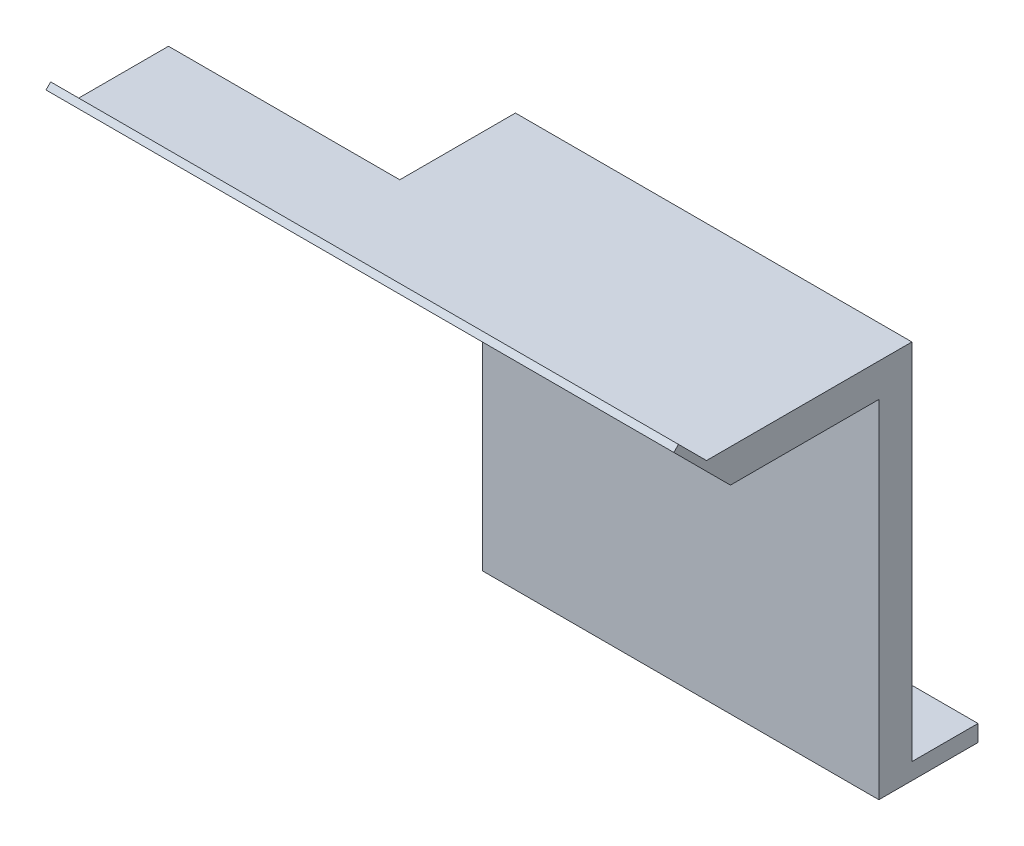
ISO-10303-21;
HEADER;
FILE_DESCRIPTION(('STEP AP214'),'2;1');
FILE_NAME('part.step','',(''),(''),'','','');
FILE_SCHEMA(('AUTOMOTIVE_DESIGN { 1 0 10303 214 1 1 1 1 }'));
ENDSEC;
DATA;
#1=APPLICATION_CONTEXT('core data for automotive mechanical design processes');
#2=APPLICATION_PROTOCOL_DEFINITION('international standard','automotive_design',2000,#1);
#3=PRODUCT_CONTEXT('',#1,'mechanical');
#4=PRODUCT('Part','Part','',(#3));
#5=PRODUCT_RELATED_PRODUCT_CATEGORY('part','',(#4));
#6=PRODUCT_DEFINITION_FORMATION('','',#4);
#7=PRODUCT_DEFINITION_CONTEXT('part definition',#1,'design');
#8=PRODUCT_DEFINITION('design','',#6,#7);
#9=PRODUCT_DEFINITION_SHAPE('','',#8);
#10=(LENGTH_UNIT() NAMED_UNIT(*) SI_UNIT(.MILLI.,.METRE.));
#11=(NAMED_UNIT(*) PLANE_ANGLE_UNIT() SI_UNIT($,.RADIAN.));
#12=(NAMED_UNIT(*) SI_UNIT($,.STERADIAN.) SOLID_ANGLE_UNIT());
#13=UNCERTAINTY_MEASURE_WITH_UNIT(LENGTH_MEASURE(1.E-05),#10,'distance_accuracy_value','');
#14=(GEOMETRIC_REPRESENTATION_CONTEXT(3) GLOBAL_UNCERTAINTY_ASSIGNED_CONTEXT((#13)) GLOBAL_UNIT_ASSIGNED_CONTEXT((#10,
#11,#12)) REPRESENTATION_CONTEXT('',''));
#15=CARTESIAN_POINT('',(0.,0.,0.));
#16=DIRECTION('',(0.,0.,1.));
#17=DIRECTION('',(1.,0.,0.));
#18=AXIS2_PLACEMENT_3D('',#15,#16,#17);
#19=CARTESIAN_POINT('',(-6.94388489208636,6.35,-31.978417266187));
#20=DIRECTION('',(1.,0.,0.));
#21=DIRECTION('',(0.,0.,-1.));
#22=AXIS2_PLACEMENT_3D('',#19,#20,#21);
#23=PLANE('',#22);
#24=DIRECTION('',(0.,0.,1.));
#25=VECTOR('',#24,1.);
#26=CARTESIAN_POINT('',(-6.94388489208636,0.,-31.978417266187));
#27=LINE('',#26,#25);
#28=CARTESIAN_POINT('',(-6.94388489208636,0.,-31.978417266187));
#29=VERTEX_POINT('',#28);
#30=CARTESIAN_POINT('',(-6.94388489208636,0.,6.12158273381296));
#31=VERTEX_POINT('',#30);
#32=EDGE_CURVE('E222',#29,#31,#27,.T.);
#33=ORIENTED_EDGE('',*,*,#32,.T.);
#34=DIRECTION('',(0.,-1.,0.));
#35=VECTOR('',#34,1.);
#36=CARTESIAN_POINT('',(-6.94388489208636,6.35,6.12158273381296));
#37=LINE('',#36,#35);
#38=CARTESIAN_POINT('',(-6.94388489208636,133.256517733172,6.12158273381296));
#39=VERTEX_POINT('',#38);
#40=EDGE_CURVE('E299',#39,#31,#37,.T.);
#41=ORIENTED_EDGE('',*,*,#40,.F.);
#42=DIRECTION('',(0.,0.,-1.));
#43=VECTOR('',#42,1.);
#44=CARTESIAN_POINT('',(-6.94388489208636,133.256517733172,-6.57841726618704));
#45=LINE('',#44,#43);
#46=CARTESIAN_POINT('',(-6.94388489208636,133.256517733172,37.871582733813));
#47=VERTEX_POINT('',#46);
#48=EDGE_CURVE('E11',#47,#39,#45,.T.);
#49=ORIENTED_EDGE('',*,*,#48,.F.);
#50=DIRECTION('',(0.,1.,0.));
#51=VECTOR('',#50,1.);
#52=CARTESIAN_POINT('',(-6.94388489208636,-6.35000000000002,37.871582733813));
#53=LINE('',#52,#51);
#54=CARTESIAN_POINT('',(-6.94388489208636,146.05,37.871582733813));
#55=VERTEX_POINT('',#54);
#56=EDGE_CURVE('E181',#47,#55,#53,.T.);
#57=ORIENTED_EDGE('',*,*,#56,.T.);
#58=DIRECTION('',(0.,0.,-1.));
#59=VECTOR('',#58,1.);
#60=CARTESIAN_POINT('',(-6.94388489208636,146.05,37.871582733813));
#61=LINE('',#60,#59);
#62=CARTESIAN_POINT('',(-6.94388489208636,146.05,-6.57841726618705));
#63=VERTEX_POINT('',#62);
#64=EDGE_CURVE('E173',#55,#63,#61,.T.);
#65=ORIENTED_EDGE('',*,*,#64,.T.);
#66=DIRECTION('',(0.,-1.,0.));
#67=VECTOR('',#66,1.);
#68=CARTESIAN_POINT('',(-6.94388489208636,146.05,-6.57841726618704));
#69=LINE('',#68,#67);
#70=CARTESIAN_POINT('',(-6.94388489208636,6.35,-6.57841726618704));
#71=VERTEX_POINT('',#70);
#72=EDGE_CURVE('E208',#63,#71,#69,.T.);
#73=ORIENTED_EDGE('',*,*,#72,.T.);
#74=DIRECTION('',(0.,0.,1.));
#75=VECTOR('',#74,1.);
#76=CARTESIAN_POINT('',(-6.94388489208636,6.35,-31.978417266187));
#77=LINE('',#76,#75);
#78=CARTESIAN_POINT('',(-6.94388489208636,6.35,-31.978417266187));
#79=VERTEX_POINT('',#78);
#80=EDGE_CURVE('E266',#79,#71,#77,.T.);
#81=ORIENTED_EDGE('',*,*,#80,.F.);
#82=DIRECTION('',(0.,-1.,0.));
#83=VECTOR('',#82,1.);
#84=CARTESIAN_POINT('',(-6.94388489208636,6.35,-31.978417266187));
#85=LINE('',#84,#83);
#86=EDGE_CURVE('E277',#79,#29,#85,.T.);
#87=ORIENTED_EDGE('',*,*,#86,.T.);
#88=EDGE_LOOP('',(#33,#41,#49,#57,#65,#73,#81,#87));
#89=FACE_BOUND('',#88,.T.);
#90=ADVANCED_FACE('F39',(#89),#23,.F.);
#91=CARTESIAN_POINT('',(-6.94388489208636,6.35,6.12158273381296));
#92=DIRECTION('',(0.,0.,-1.));
#93=DIRECTION('',(-1.,0.,0.));
#94=AXIS2_PLACEMENT_3D('',#91,#92,#93);
#95=PLANE('',#94);
#96=DIRECTION('',(1.,0.,0.));
#97=VECTOR('',#96,1.);
#98=CARTESIAN_POINT('',(-6.94388489208636,133.256517733172,6.12158273381296));
#99=LINE('',#98,#97);
#100=CARTESIAN_POINT('',(145.456115107914,133.256517733172,6.12158273381296));
#101=VERTEX_POINT('',#100);
#102=EDGE_CURVE('E196',#39,#101,#99,.T.);
#103=ORIENTED_EDGE('',*,*,#102,.F.);
#104=ORIENTED_EDGE('',*,*,#40,.T.);
#105=DIRECTION('',(1.,0.,0.));
#106=VECTOR('',#105,1.);
#107=CARTESIAN_POINT('',(-6.94388489208636,0.,6.12158273381296));
#108=LINE('',#107,#106);
#109=CARTESIAN_POINT('',(145.456115107914,0.,6.12158273381296));
#110=VERTEX_POINT('',#109);
#111=EDGE_CURVE('E280',#31,#110,#108,.T.);
#112=ORIENTED_EDGE('',*,*,#111,.T.);
#113=DIRECTION('',(0.,-1.,0.));
#114=VECTOR('',#113,1.);
#115=CARTESIAN_POINT('',(145.456115107914,6.35,6.12158273381296));
#116=LINE('',#115,#114);
#117=EDGE_CURVE('E296',#101,#110,#116,.T.);
#118=ORIENTED_EDGE('',*,*,#117,.F.);
#119=EDGE_LOOP('',(#103,#104,#112,#118));
#120=FACE_BOUND('',#119,.T.);
#121=ADVANCED_FACE('F328',(#120),#95,.F.);
#122=CARTESIAN_POINT('',(145.456115107914,6.35,-31.978417266187));
#123=DIRECTION('',(-1.,0.,0.));
#124=DIRECTION('',(0.,0.,1.));
#125=AXIS2_PLACEMENT_3D('',#122,#123,#124);
#126=PLANE('',#125);
#127=DIRECTION('',(0.,-0.707106781186549,-0.707106781186546));
#128=VECTOR('',#127,1.);
#129=CARTESIAN_POINT('',(145.456115107914,146.05,75.971582733813));
#130=LINE('',#129,#128);
#131=CARTESIAN_POINT('',(145.456115107914,155.030256121069,84.9518388548821));
#132=VERTEX_POINT('',#131);
#133=CARTESIAN_POINT('',(145.456115107914,133.256517733172,63.1781004669848));
#134=VERTEX_POINT('',#133);
#135=EDGE_CURVE('E130',#132,#134,#130,.T.);
#136=ORIENTED_EDGE('',*,*,#135,.T.);
#137=DIRECTION('',(0.,0.,1.));
#138=VECTOR('',#137,1.);
#139=CARTESIAN_POINT('',(145.456115107914,133.256517733172,-6.57841726618704));
#140=LINE('',#139,#138);
#141=EDGE_CURVE('E186',#101,#134,#140,.T.);
#142=ORIENTED_EDGE('',*,*,#141,.F.);
#143=ORIENTED_EDGE('',*,*,#117,.T.);
#144=DIRECTION('',(0.,0.,-1.));
#145=VECTOR('',#144,1.);
#146=CARTESIAN_POINT('',(145.456115107914,0.,-31.978417266187));
#147=LINE('',#146,#145);
#148=CARTESIAN_POINT('',(145.456115107914,0.,-31.978417266187));
#149=VERTEX_POINT('',#148);
#150=EDGE_CURVE('E284',#110,#149,#147,.T.);
#151=ORIENTED_EDGE('',*,*,#150,.T.);
#152=DIRECTION('',(0.,-1.,0.));
#153=VECTOR('',#152,1.);
#154=CARTESIAN_POINT('',(145.456115107914,6.35,-31.978417266187));
#155=LINE('',#154,#153);
#156=CARTESIAN_POINT('',(145.456115107914,6.35,-31.978417266187));
#157=VERTEX_POINT('',#156);
#158=EDGE_CURVE('E292',#157,#149,#155,.T.);
#159=ORIENTED_EDGE('',*,*,#158,.F.);
#160=DIRECTION('',(0.,0.,-1.));
#161=VECTOR('',#160,1.);
#162=CARTESIAN_POINT('',(145.456115107914,6.35,-31.978417266187));
#163=LINE('',#162,#161);
#164=CARTESIAN_POINT('',(145.456115107914,6.35,-6.57841726618705));
#165=VERTEX_POINT('',#164);
#166=EDGE_CURVE('E270',#165,#157,#163,.T.);
#167=ORIENTED_EDGE('',*,*,#166,.F.);
#168=DIRECTION('',(0.,-1.,0.));
#169=VECTOR('',#168,1.);
#170=CARTESIAN_POINT('',(145.456115107914,146.05,-6.57841726618704));
#171=LINE('',#170,#169);
#172=CARTESIAN_POINT('',(145.456115107914,146.05,-6.57841726618704));
#173=VERTEX_POINT('',#172);
#174=EDGE_CURVE('E214',#173,#165,#171,.T.);
#175=ORIENTED_EDGE('',*,*,#174,.F.);
#176=DIRECTION('',(0.,0.,-1.));
#177=VECTOR('',#176,1.);
#178=CARTESIAN_POINT('',(145.456115107914,146.05,-6.57841726618704));
#179=LINE('',#178,#177);
#180=CARTESIAN_POINT('',(145.456115107914,146.05,72.3794802853852));
#181=VERTEX_POINT('',#180);
#182=EDGE_CURVE('E201',#181,#173,#179,.T.);
#183=ORIENTED_EDGE('',*,*,#182,.F.);
#184=DIRECTION('',(0.,-0.707106781186548,-0.707106781186547));
#185=VECTOR('',#184,1.);
#186=CARTESIAN_POINT('',(145.456115107914,156.826307345283,83.1557876306682));
#187=LINE('',#186,#185);
#188=CARTESIAN_POINT('',(145.456115107914,156.826307345283,83.1557876306682));
#189=VERTEX_POINT('',#188);
#190=EDGE_CURVE('E150',#189,#181,#187,.T.);
#191=ORIENTED_EDGE('',*,*,#190,.F.);
#192=DIRECTION('',(0.,0.707106781186548,-0.707106781186548));
#193=VECTOR('',#192,1.);
#194=CARTESIAN_POINT('',(145.456115107914,155.030256121069,84.9518388548821));
#195=LINE('',#194,#193);
#196=EDGE_CURVE('E146',#132,#189,#195,.T.);
#197=ORIENTED_EDGE('',*,*,#196,.F.);
#198=EDGE_LOOP('',(#136,#142,#143,#151,#159,#167,#175,#183,#191,#197));
#199=FACE_BOUND('',#198,.T.);
#200=ADVANCED_FACE('F153',(#199),#126,.F.);
#201=CARTESIAN_POINT('',(-6.94388489208636,6.35,-31.978417266187));
#202=DIRECTION('',(0.,0.,1.));
#203=DIRECTION('',(1.,0.,0.));
#204=AXIS2_PLACEMENT_3D('',#201,#202,#203);
#205=PLANE('',#204);
#206=DIRECTION('',(-1.,0.,0.));
#207=VECTOR('',#206,1.);
#208=CARTESIAN_POINT('',(-6.94388489208636,0.,-31.978417266187));
#209=LINE('',#208,#207);
#210=EDGE_CURVE('E271',#149,#29,#209,.T.);
#211=ORIENTED_EDGE('',*,*,#210,.T.);
#212=ORIENTED_EDGE('',*,*,#86,.F.);
#213=DIRECTION('',(-1.,0.,0.));
#214=VECTOR('',#213,1.);
#215=CARTESIAN_POINT('',(-6.94388489208636,6.35,-31.978417266187));
#216=LINE('',#215,#214);
#217=EDGE_CURVE('E274',#157,#79,#216,.T.);
#218=ORIENTED_EDGE('',*,*,#217,.F.);
#219=ORIENTED_EDGE('',*,*,#158,.T.);
#220=EDGE_LOOP('',(#211,#212,#218,#219));
#221=FACE_BOUND('',#220,.T.);
#222=ADVANCED_FACE('F336',(#221),#205,.F.);
#223=CARTESIAN_POINT('',(0.,6.35,0.));
#224=DIRECTION('',(0.,1.,0.));
#225=DIRECTION('',(0.,0.,1.));
#226=AXIS2_PLACEMENT_3D('',#223,#224,#225);
#227=PLANE('',#226);
#228=DIRECTION('',(-1.,0.,0.));
#229=VECTOR('',#228,1.);
#230=CARTESIAN_POINT('',(-6.94388489208636,6.35,-6.57841726618704));
#231=LINE('',#230,#229);
#232=EDGE_CURVE('E200',#165,#71,#231,.T.);
#233=ORIENTED_EDGE('',*,*,#232,.F.);
#234=ORIENTED_EDGE('',*,*,#166,.T.);
#235=ORIENTED_EDGE('',*,*,#217,.T.);
#236=ORIENTED_EDGE('',*,*,#80,.T.);
#237=EDGE_LOOP('',(#233,#234,#235,#236));
#238=FACE_BOUND('',#237,.T.);
#239=CARTESIAN_POINT('',(-0.593884892086366,6.35,-12.928417266187));
#240=DIRECTION('',(0.,1.,0.));
#241=DIRECTION('',(0.,0.,1.));
#242=AXIS2_PLACEMENT_3D('',#239,#240,#241);
#243=CIRCLE('',#242,3.175);
#244=CARTESIAN_POINT('',(-0.593884892086366,6.35,-9.75341726618704));
#245=VERTEX_POINT('',#244);
#246=EDGE_CURVE('E223',#245,#245,#243,.T.);
#247=ORIENTED_EDGE('',*,*,#246,.F.);
#248=EDGE_LOOP('',(#247));
#249=FACE_BOUND('',#248,.T.);
#250=CARTESIAN_POINT('',(24.8061151079136,6.35,-12.928417266187));
#251=DIRECTION('',(0.,1.,0.));
#252=DIRECTION('',(0.,0.,1.));
#253=AXIS2_PLACEMENT_3D('',#250,#251,#252);
#254=CIRCLE('',#253,3.175);
#255=CARTESIAN_POINT('',(24.8061151079136,6.35,-9.75341726618704));
#256=VERTEX_POINT('',#255);
#257=EDGE_CURVE('E231',#256,#256,#254,.T.);
#258=ORIENTED_EDGE('',*,*,#257,.F.);
#259=EDGE_LOOP('',(#258));
#260=FACE_BOUND('',#259,.T.);
#261=CARTESIAN_POINT('',(50.2061151079136,6.35,-12.928417266187));
#262=DIRECTION('',(0.,1.,0.));
#263=DIRECTION('',(0.,0.,1.));
#264=AXIS2_PLACEMENT_3D('',#261,#262,#263);
#265=CIRCLE('',#264,3.175);
#266=CARTESIAN_POINT('',(50.2061151079136,6.35,-9.75341726618705));
#267=VERTEX_POINT('',#266);
#268=EDGE_CURVE('E239',#267,#267,#265,.T.);
#269=ORIENTED_EDGE('',*,*,#268,.F.);
#270=EDGE_LOOP('',(#269));
#271=FACE_BOUND('',#270,.T.);
#272=CARTESIAN_POINT('',(75.6061151079136,6.35,-12.928417266187));
#273=DIRECTION('',(0.,1.,0.));
#274=DIRECTION('',(0.,0.,1.));
#275=AXIS2_PLACEMENT_3D('',#272,#273,#274);
#276=CIRCLE('',#275,3.175);
#277=CARTESIAN_POINT('',(75.6061151079136,6.35,-9.75341726618705));
#278=VERTEX_POINT('',#277);
#279=EDGE_CURVE('E247',#278,#278,#276,.T.);
#280=ORIENTED_EDGE('',*,*,#279,.F.);
#281=EDGE_LOOP('',(#280));
#282=FACE_BOUND('',#281,.T.);
#283=CARTESIAN_POINT('',(101.006115107914,6.35,-12.928417266187));
#284=DIRECTION('',(0.,1.,0.));
#285=DIRECTION('',(0.,0.,1.));
#286=AXIS2_PLACEMENT_3D('',#283,#284,#285);
#287=CIRCLE('',#286,3.175);
#288=CARTESIAN_POINT('',(101.006115107914,6.35,-9.75341726618705));
#289=VERTEX_POINT('',#288);
#290=EDGE_CURVE('E255',#289,#289,#287,.T.);
#291=ORIENTED_EDGE('',*,*,#290,.F.);
#292=EDGE_LOOP('',(#291));
#293=FACE_BOUND('',#292,.T.);
#294=CARTESIAN_POINT('',(126.406115107914,6.35,-12.928417266187));
#295=DIRECTION('',(0.,1.,0.));
#296=DIRECTION('',(0.,0.,1.));
#297=AXIS2_PLACEMENT_3D('',#294,#295,#296);
#298=CIRCLE('',#297,3.175);
#299=CARTESIAN_POINT('',(126.406115107914,6.35,-9.75341726618705));
#300=VERTEX_POINT('',#299);
#301=EDGE_CURVE('E217',#300,#300,#298,.T.);
#302=ORIENTED_EDGE('',*,*,#301,.F.);
#303=EDGE_LOOP('',(#302));
#304=FACE_BOUND('',#303,.T.);
#305=ADVANCED_FACE('F341',(#238,#249,#260,#271,#282,#293,#304),#227,.T.);
#306=CARTESIAN_POINT('',(0.,0.,0.));
#307=DIRECTION('',(0.,1.,0.));
#308=DIRECTION('',(0.,0.,1.));
#309=AXIS2_PLACEMENT_3D('',#306,#307,#308);
#310=PLANE('',#309);
#311=CARTESIAN_POINT('',(-0.593884892086366,0.,-12.928417266187));
#312=DIRECTION('',(0.,1.,0.));
#313=DIRECTION('',(0.,0.,1.));
#314=AXIS2_PLACEMENT_3D('',#311,#312,#313);
#315=CIRCLE('',#314,3.175);
#316=CARTESIAN_POINT('',(-0.593884892086366,0.,-9.75341726618704));
#317=VERTEX_POINT('',#316);
#318=EDGE_CURVE('E218',#317,#317,#315,.T.);
#319=ORIENTED_EDGE('',*,*,#318,.T.);
#320=EDGE_LOOP('',(#319));
#321=FACE_BOUND('',#320,.T.);
#322=CARTESIAN_POINT('',(24.8061151079136,0.,-12.928417266187));
#323=DIRECTION('',(0.,1.,0.));
#324=DIRECTION('',(0.,0.,1.));
#325=AXIS2_PLACEMENT_3D('',#322,#323,#324);
#326=CIRCLE('',#325,3.175);
#327=CARTESIAN_POINT('',(24.8061151079136,0.,-9.75341726618704));
#328=VERTEX_POINT('',#327);
#329=EDGE_CURVE('E227',#328,#328,#326,.T.);
#330=ORIENTED_EDGE('',*,*,#329,.T.);
#331=EDGE_LOOP('',(#330));
#332=FACE_BOUND('',#331,.T.);
#333=CARTESIAN_POINT('',(50.2061151079136,0.,-12.928417266187));
#334=DIRECTION('',(0.,1.,0.));
#335=DIRECTION('',(0.,0.,1.));
#336=AXIS2_PLACEMENT_3D('',#333,#334,#335);
#337=CIRCLE('',#336,3.175);
#338=CARTESIAN_POINT('',(50.2061151079136,0.,-9.75341726618705));
#339=VERTEX_POINT('',#338);
#340=EDGE_CURVE('E235',#339,#339,#337,.T.);
#341=ORIENTED_EDGE('',*,*,#340,.T.);
#342=EDGE_LOOP('',(#341));
#343=FACE_BOUND('',#342,.T.);
#344=CARTESIAN_POINT('',(75.6061151079136,0.,-12.928417266187));
#345=DIRECTION('',(0.,1.,0.));
#346=DIRECTION('',(0.,0.,1.));
#347=AXIS2_PLACEMENT_3D('',#344,#345,#346);
#348=CIRCLE('',#347,3.175);
#349=CARTESIAN_POINT('',(75.6061151079136,0.,-9.75341726618705));
#350=VERTEX_POINT('',#349);
#351=EDGE_CURVE('E243',#350,#350,#348,.T.);
#352=ORIENTED_EDGE('',*,*,#351,.T.);
#353=EDGE_LOOP('',(#352));
#354=FACE_BOUND('',#353,.T.);
#355=CARTESIAN_POINT('',(101.006115107914,0.,-12.928417266187));
#356=DIRECTION('',(0.,1.,0.));
#357=DIRECTION('',(0.,0.,1.));
#358=AXIS2_PLACEMENT_3D('',#355,#356,#357);
#359=CIRCLE('',#358,3.175);
#360=CARTESIAN_POINT('',(101.006115107914,0.,-9.75341726618705));
#361=VERTEX_POINT('',#360);
#362=EDGE_CURVE('E251',#361,#361,#359,.T.);
#363=ORIENTED_EDGE('',*,*,#362,.T.);
#364=EDGE_LOOP('',(#363));
#365=FACE_BOUND('',#364,.T.);
#366=CARTESIAN_POINT('',(126.406115107914,0.,-12.928417266187));
#367=DIRECTION('',(0.,1.,0.));
#368=DIRECTION('',(0.,0.,1.));
#369=AXIS2_PLACEMENT_3D('',#366,#367,#368);
#370=CIRCLE('',#369,3.175);
#371=CARTESIAN_POINT('',(126.406115107914,0.,-9.75341726618705));
#372=VERTEX_POINT('',#371);
#373=EDGE_CURVE('E259',#372,#372,#370,.T.);
#374=ORIENTED_EDGE('',*,*,#373,.T.);
#375=EDGE_LOOP('',(#374));
#376=FACE_BOUND('',#375,.T.);
#377=ORIENTED_EDGE('',*,*,#32,.F.);
#378=ORIENTED_EDGE('',*,*,#210,.F.);
#379=ORIENTED_EDGE('',*,*,#150,.F.);
#380=ORIENTED_EDGE('',*,*,#111,.F.);
#381=EDGE_LOOP('',(#377,#378,#379,#380));
#382=FACE_BOUND('',#381,.T.);
#383=ADVANCED_FACE('F343',(#321,#332,#343,#354,#365,#376,#382),#310,.F.);
#384=CARTESIAN_POINT('',(126.406115107914,0.,-12.928417266187));
#385=DIRECTION('',(0.,1.,0.));
#386=DIRECTION('',(0.,0.,1.));
#387=AXIS2_PLACEMENT_3D('',#384,#385,#386);
#388=CYLINDRICAL_SURFACE('',#387,3.175);
#389=ORIENTED_EDGE('',*,*,#373,.F.);
#390=EDGE_LOOP('',(#389));
#391=FACE_BOUND('',#390,.T.);
#392=ORIENTED_EDGE('',*,*,#301,.T.);
#393=EDGE_LOOP('',(#392));
#394=FACE_BOUND('',#393,.T.);
#395=ADVANCED_FACE('F346',(#391,#394),#388,.F.);
#396=CARTESIAN_POINT('',(101.006115107914,0.,-12.928417266187));
#397=DIRECTION('',(0.,1.,0.));
#398=DIRECTION('',(0.,0.,1.));
#399=AXIS2_PLACEMENT_3D('',#396,#397,#398);
#400=CYLINDRICAL_SURFACE('',#399,3.175);
#401=ORIENTED_EDGE('',*,*,#362,.F.);
#402=EDGE_LOOP('',(#401));
#403=FACE_BOUND('',#402,.T.);
#404=ORIENTED_EDGE('',*,*,#290,.T.);
#405=EDGE_LOOP('',(#404));
#406=FACE_BOUND('',#405,.T.);
#407=ADVANCED_FACE('F353',(#403,#406),#400,.F.);
#408=CARTESIAN_POINT('',(75.6061151079136,0.,-12.928417266187));
#409=DIRECTION('',(0.,1.,0.));
#410=DIRECTION('',(0.,0.,1.));
#411=AXIS2_PLACEMENT_3D('',#408,#409,#410);
#412=CYLINDRICAL_SURFACE('',#411,3.175);
#413=ORIENTED_EDGE('',*,*,#351,.F.);
#414=EDGE_LOOP('',(#413));
#415=FACE_BOUND('',#414,.T.);
#416=ORIENTED_EDGE('',*,*,#279,.T.);
#417=EDGE_LOOP('',(#416));
#418=FACE_BOUND('',#417,.T.);
#419=ADVANCED_FACE('F357',(#415,#418),#412,.F.);
#420=CARTESIAN_POINT('',(50.2061151079136,0.,-12.928417266187));
#421=DIRECTION('',(0.,1.,0.));
#422=DIRECTION('',(0.,0.,1.));
#423=AXIS2_PLACEMENT_3D('',#420,#421,#422);
#424=CYLINDRICAL_SURFACE('',#423,3.175);
#425=ORIENTED_EDGE('',*,*,#340,.F.);
#426=EDGE_LOOP('',(#425));
#427=FACE_BOUND('',#426,.T.);
#428=ORIENTED_EDGE('',*,*,#268,.T.);
#429=EDGE_LOOP('',(#428));
#430=FACE_BOUND('',#429,.T.);
#431=ADVANCED_FACE('F361',(#427,#430),#424,.F.);
#432=CARTESIAN_POINT('',(24.8061151079136,0.,-12.928417266187));
#433=DIRECTION('',(0.,1.,0.));
#434=DIRECTION('',(0.,0.,1.));
#435=AXIS2_PLACEMENT_3D('',#432,#433,#434);
#436=CYLINDRICAL_SURFACE('',#435,3.175);
#437=ORIENTED_EDGE('',*,*,#329,.F.);
#438=EDGE_LOOP('',(#437));
#439=FACE_BOUND('',#438,.T.);
#440=ORIENTED_EDGE('',*,*,#257,.T.);
#441=EDGE_LOOP('',(#440));
#442=FACE_BOUND('',#441,.T.);
#443=ADVANCED_FACE('F365',(#439,#442),#436,.F.);
#444=CARTESIAN_POINT('',(-0.593884892086366,0.,-12.928417266187));
#445=DIRECTION('',(0.,1.,0.));
#446=DIRECTION('',(0.,0.,1.));
#447=AXIS2_PLACEMENT_3D('',#444,#445,#446);
#448=CYLINDRICAL_SURFACE('',#447,3.175);
#449=ORIENTED_EDGE('',*,*,#318,.F.);
#450=EDGE_LOOP('',(#449));
#451=FACE_BOUND('',#450,.T.);
#452=ORIENTED_EDGE('',*,*,#246,.T.);
#453=EDGE_LOOP('',(#452));
#454=FACE_BOUND('',#453,.T.);
#455=ADVANCED_FACE('F369',(#451,#454),#448,.F.);
#456=CARTESIAN_POINT('',(-6.94388489208636,146.05,-6.57841726618704));
#457=DIRECTION('',(0.,0.,1.));
#458=DIRECTION('',(1.,0.,0.));
#459=AXIS2_PLACEMENT_3D('',#456,#457,#458);
#460=PLANE('',#459);
#461=ORIENTED_EDGE('',*,*,#72,.F.);
#462=DIRECTION('',(-1.,0.,0.));
#463=VECTOR('',#462,1.);
#464=CARTESIAN_POINT('',(-6.94388489208636,146.05,-6.57841726618704));
#465=LINE('',#464,#463);
#466=EDGE_CURVE('E204',#173,#63,#465,.T.);
#467=ORIENTED_EDGE('',*,*,#466,.F.);
#468=ORIENTED_EDGE('',*,*,#174,.T.);
#469=ORIENTED_EDGE('',*,*,#232,.T.);
#470=EDGE_LOOP('',(#461,#467,#468,#469));
#471=FACE_BOUND('',#470,.T.);
#472=ADVANCED_FACE('F373',(#471),#460,.F.);
#473=CARTESIAN_POINT('',(0.,146.05,0.));
#474=DIRECTION('',(0.,1.,0.));
#475=DIRECTION('',(0.,0.,1.));
#476=AXIS2_PLACEMENT_3D('',#473,#474,#475);
#477=PLANE('',#476);
#478=DIRECTION('',(-1.,0.,0.));
#479=VECTOR('',#478,1.);
#480=CARTESIAN_POINT('',(0.,146.05,72.3794802853852));
#481=LINE('',#480,#479);
#482=CARTESIAN_POINT('',(-95.8438848920864,146.05,72.3794802853853));
#483=VERTEX_POINT('',#482);
#484=EDGE_CURVE('E165',#181,#483,#481,.T.);
#485=ORIENTED_EDGE('',*,*,#484,.F.);
#486=ORIENTED_EDGE('',*,*,#182,.T.);
#487=ORIENTED_EDGE('',*,*,#466,.T.);
#488=ORIENTED_EDGE('',*,*,#64,.F.);
#489=DIRECTION('',(1.,0.,0.));
#490=VECTOR('',#489,1.);
#491=CARTESIAN_POINT('',(-6.94388489208636,146.05,37.871582733813));
#492=LINE('',#491,#490);
#493=CARTESIAN_POINT('',(-95.8438848920864,146.05,37.871582733813));
#494=VERTEX_POINT('',#493);
#495=EDGE_CURVE('E177',#494,#55,#492,.T.);
#496=ORIENTED_EDGE('',*,*,#495,.F.);
#497=DIRECTION('',(0.,0.,-1.));
#498=VECTOR('',#497,1.);
#499=CARTESIAN_POINT('',(-95.8438848920864,146.05,-6.57841726618704));
#500=LINE('',#499,#498);
#501=EDGE_CURVE('E193',#483,#494,#500,.T.);
#502=ORIENTED_EDGE('',*,*,#501,.F.);
#503=EDGE_LOOP('',(#485,#486,#487,#488,#496,#502));
#504=FACE_BOUND('',#503,.T.);
#505=ADVANCED_FACE('F310',(#504),#477,.T.);
#506=CARTESIAN_POINT('',(-95.8438848920864,133.256517733172,-6.57841726618704));
#507=DIRECTION('',(0.,1.,0.));
#508=DIRECTION('',(0.,0.,1.));
#509=AXIS2_PLACEMENT_3D('',#506,#507,#508);
#510=PLANE('',#509);
#511=ORIENTED_EDGE('',*,*,#141,.T.);
#512=DIRECTION('',(-1.,0.,0.));
#513=VECTOR('',#512,1.);
#514=CARTESIAN_POINT('',(145.456115107914,133.256517733172,63.1781004669848));
#515=LINE('',#514,#513);
#516=CARTESIAN_POINT('',(-95.8438848920864,133.256517733172,63.1781004669848));
#517=VERTEX_POINT('',#516);
#518=EDGE_CURVE('E136',#134,#517,#515,.T.);
#519=ORIENTED_EDGE('',*,*,#518,.T.);
#520=DIRECTION('',(0.,0.,1.));
#521=VECTOR('',#520,1.);
#522=CARTESIAN_POINT('',(-95.8438848920864,133.256517733172,-6.57841726618704));
#523=LINE('',#522,#521);
#524=CARTESIAN_POINT('',(-95.8438848920864,133.256517733172,37.871582733813));
#525=VERTEX_POINT('',#524);
#526=EDGE_CURVE('E189',#525,#517,#523,.T.);
#527=ORIENTED_EDGE('',*,*,#526,.F.);
#528=DIRECTION('',(1.,0.,0.));
#529=VECTOR('',#528,1.);
#530=CARTESIAN_POINT('',(-95.8438848920864,133.256517733172,37.871582733813));
#531=LINE('',#530,#529);
#532=EDGE_CURVE('E62',#525,#47,#531,.T.);
#533=ORIENTED_EDGE('',*,*,#532,.T.);
#534=ORIENTED_EDGE('',*,*,#48,.T.);
#535=ORIENTED_EDGE('',*,*,#102,.T.);
#536=EDGE_LOOP('',(#511,#519,#527,#533,#534,#535));
#537=FACE_BOUND('',#536,.T.);
#538=ADVANCED_FACE('F316',(#537),#510,.F.);
#539=CARTESIAN_POINT('',(-95.8438848920864,0.,0.));
#540=DIRECTION('',(-1.,0.,0.));
#541=DIRECTION('',(0.,0.,1.));
#542=AXIS2_PLACEMENT_3D('',#539,#540,#541);
#543=PLANE('',#542);
#544=ORIENTED_EDGE('',*,*,#526,.T.);
#545=DIRECTION('',(0.,-0.707106781186549,-0.707106781186546));
#546=VECTOR('',#545,1.);
#547=CARTESIAN_POINT('',(-95.8438848920864,146.05,75.971582733813));
#548=LINE('',#547,#546);
#549=CARTESIAN_POINT('',(-95.8438848920864,155.030256121069,84.9518388548821));
#550=VERTEX_POINT('',#549);
#551=EDGE_CURVE('E141',#550,#517,#548,.T.);
#552=ORIENTED_EDGE('',*,*,#551,.F.);
#553=DIRECTION('',(0.,0.707106781186548,-0.707106781186548));
#554=VECTOR('',#553,1.);
#555=CARTESIAN_POINT('',(-95.8438848920864,155.030256121069,84.9518388548821));
#556=LINE('',#555,#554);
#557=CARTESIAN_POINT('',(-95.8438848920864,156.826307345283,83.1557876306682));
#558=VERTEX_POINT('',#557);
#559=EDGE_CURVE('E147',#550,#558,#556,.T.);
#560=ORIENTED_EDGE('',*,*,#559,.T.);
#561=DIRECTION('',(0.,-0.707106781186548,-0.707106781186547));
#562=VECTOR('',#561,1.);
#563=CARTESIAN_POINT('',(-95.8438848920864,156.826307345283,83.1557876306682));
#564=LINE('',#563,#562);
#565=EDGE_CURVE('E54',#558,#483,#564,.T.);
#566=ORIENTED_EDGE('',*,*,#565,.T.);
#567=ORIENTED_EDGE('',*,*,#501,.T.);
#568=DIRECTION('',(0.,1.,0.));
#569=VECTOR('',#568,1.);
#570=CARTESIAN_POINT('',(-95.8438848920864,0.,37.871582733813));
#571=LINE('',#570,#569);
#572=EDGE_CURVE('E47',#525,#494,#571,.T.);
#573=ORIENTED_EDGE('',*,*,#572,.F.);
#574=EDGE_LOOP('',(#544,#552,#560,#566,#567,#573));
#575=FACE_BOUND('',#574,.T.);
#576=ADVANCED_FACE('F318',(#575),#543,.T.);
#577=CARTESIAN_POINT('',(-6.94388489208636,-6.35000000000002,37.871582733813));
#578=DIRECTION('',(0.,0.,1.));
#579=DIRECTION('',(1.,0.,0.));
#580=AXIS2_PLACEMENT_3D('',#577,#578,#579);
#581=PLANE('',#580);
#582=ORIENTED_EDGE('',*,*,#572,.T.);
#583=ORIENTED_EDGE('',*,*,#495,.T.);
#584=ORIENTED_EDGE('',*,*,#56,.F.);
#585=ORIENTED_EDGE('',*,*,#532,.F.);
#586=EDGE_LOOP('',(#582,#583,#584,#585));
#587=FACE_BOUND('',#586,.T.);
#588=ADVANCED_FACE('F304',(#587),#581,.F.);
#589=CARTESIAN_POINT('',(145.456115107914,146.05,75.971582733813));
#590=DIRECTION('',(0.,0.707106781186546,-0.707106781186549));
#591=DIRECTION('',(0.,0.707106781186549,0.707106781186546));
#592=AXIS2_PLACEMENT_3D('',#589,#590,#591);
#593=PLANE('',#592);
#594=ORIENTED_EDGE('',*,*,#518,.F.);
#595=ORIENTED_EDGE('',*,*,#135,.F.);
#596=DIRECTION('',(-1.,0.,0.));
#597=VECTOR('',#596,1.);
#598=CARTESIAN_POINT('',(145.456115107914,155.030256121069,84.9518388548821));
#599=LINE('',#598,#597);
#600=EDGE_CURVE('E133',#132,#550,#599,.T.);
#601=ORIENTED_EDGE('',*,*,#600,.T.);
#602=ORIENTED_EDGE('',*,*,#551,.T.);
#603=EDGE_LOOP('',(#594,#595,#601,#602));
#604=FACE_BOUND('',#603,.T.);
#605=ADVANCED_FACE('F132',(#604),#593,.F.);
#606=CARTESIAN_POINT('',(145.456115107914,156.826307345283,83.1557876306682));
#607=DIRECTION('',(0.,0.707106781186547,-0.707106781186548));
#608=DIRECTION('',(0.,0.707106781186548,0.707106781186547));
#609=AXIS2_PLACEMENT_3D('',#606,#607,#608);
#610=PLANE('',#609);
#611=ORIENTED_EDGE('',*,*,#190,.T.);
#612=ORIENTED_EDGE('',*,*,#484,.T.);
#613=ORIENTED_EDGE('',*,*,#565,.F.);
#614=DIRECTION('',(-1.,0.,0.));
#615=VECTOR('',#614,1.);
#616=CARTESIAN_POINT('',(145.456115107914,156.826307345283,83.1557876306682));
#617=LINE('',#616,#615);
#618=EDGE_CURVE('E149',#189,#558,#617,.T.);
#619=ORIENTED_EDGE('',*,*,#618,.F.);
#620=EDGE_LOOP('',(#611,#612,#613,#619));
#621=FACE_BOUND('',#620,.T.);
#622=ADVANCED_FACE('F488',(#621),#610,.T.);
#623=CARTESIAN_POINT('',(145.456115107914,155.030256121069,84.9518388548821));
#624=DIRECTION('',(0.,0.707106781186548,0.707106781186548));
#625=DIRECTION('',(0.,-0.707106781186548,0.707106781186548));
#626=AXIS2_PLACEMENT_3D('',#623,#624,#625);
#627=PLANE('',#626);
#628=ORIENTED_EDGE('',*,*,#559,.F.);
#629=ORIENTED_EDGE('',*,*,#600,.F.);
#630=ORIENTED_EDGE('',*,*,#196,.T.);
#631=ORIENTED_EDGE('',*,*,#618,.T.);
#632=EDGE_LOOP('',(#628,#629,#630,#631));
#633=FACE_BOUND('',#632,.T.);
#634=ADVANCED_FACE('F145',(#633),#627,.T.);
#635=CLOSED_SHELL('',(#90,#121,#200,#222,#305,#383,#395,#407,#419,#431,#443,#455,#472,#505,#538,
#576,#588,#605,#622,#634));
#636=MANIFOLD_SOLID_BREP('B2',#635);
#637=ADVANCED_BREP_SHAPE_REPRESENTATION('',(#18,#636),#14);
#638=SHAPE_DEFINITION_REPRESENTATION(#9,#637);
ENDSEC;
END-ISO-10303-21;
